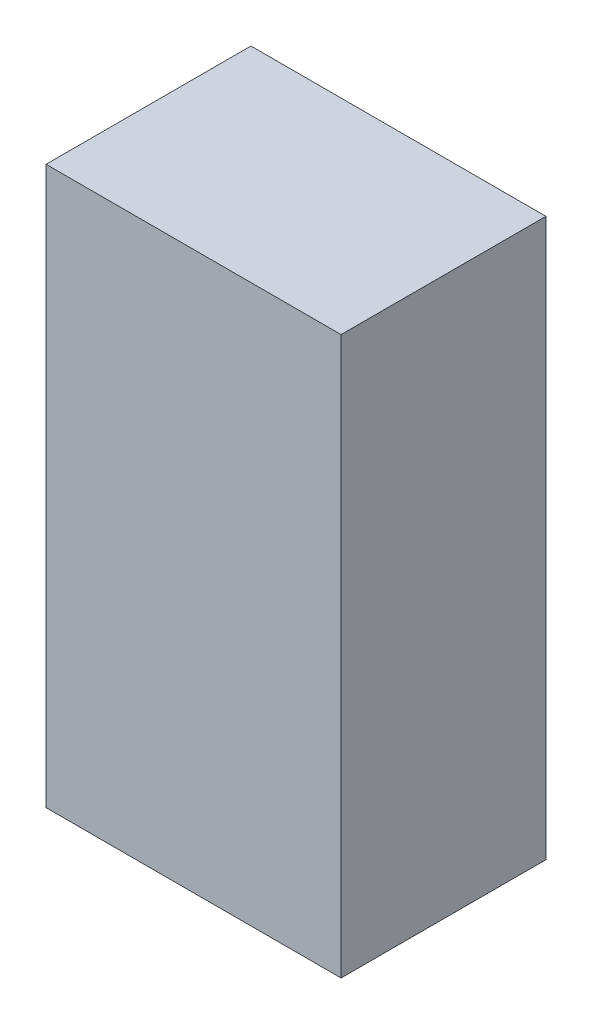
ISO-10303-21;
HEADER;
FILE_DESCRIPTION(('STEP AP214'),'2;1');
FILE_NAME('part.step','',(''),(''),'','','');
FILE_SCHEMA(('AUTOMOTIVE_DESIGN { 1 0 10303 214 1 1 1 1 }'));
ENDSEC;
DATA;
#1=APPLICATION_CONTEXT('core data for automotive mechanical design processes');
#2=APPLICATION_PROTOCOL_DEFINITION('international standard','automotive_design',2000,#1);
#3=PRODUCT_CONTEXT('',#1,'mechanical');
#4=PRODUCT('Part','Part','',(#3));
#5=PRODUCT_RELATED_PRODUCT_CATEGORY('part','',(#4));
#6=PRODUCT_DEFINITION_FORMATION('','',#4);
#7=PRODUCT_DEFINITION_CONTEXT('part definition',#1,'design');
#8=PRODUCT_DEFINITION('design','',#6,#7);
#9=PRODUCT_DEFINITION_SHAPE('','',#8);
#10=(LENGTH_UNIT() NAMED_UNIT(*) SI_UNIT(.MILLI.,.METRE.));
#11=(NAMED_UNIT(*) PLANE_ANGLE_UNIT() SI_UNIT($,.RADIAN.));
#12=(NAMED_UNIT(*) SI_UNIT($,.STERADIAN.) SOLID_ANGLE_UNIT());
#13=UNCERTAINTY_MEASURE_WITH_UNIT(LENGTH_MEASURE(1.E-05),#10,'distance_accuracy_value','');
#14=(GEOMETRIC_REPRESENTATION_CONTEXT(3) GLOBAL_UNCERTAINTY_ASSIGNED_CONTEXT((#13)) GLOBAL_UNIT_ASSIGNED_CONTEXT((#10,
#11,#12)) REPRESENTATION_CONTEXT('',''));
#15=CARTESIAN_POINT('',(0.,0.,0.));
#16=DIRECTION('',(0.,0.,1.));
#17=DIRECTION('',(1.,0.,0.));
#18=AXIS2_PLACEMENT_3D('',#15,#16,#17);
#19=CARTESIAN_POINT('',(0.90000074,-1.69999914,1.25000004));
#20=DIRECTION('',(0.,0.,1.));
#21=DIRECTION('',(1.,0.,0.));
#22=AXIS2_PLACEMENT_3D('',#19,#20,#21);
#23=PLANE('',#22);
#24=DIRECTION('',(0.,1.,0.));
#25=VECTOR('',#24,1.);
#26=CARTESIAN_POINT('',(-0.8999982,-1.69999914,1.25000004));
#27=LINE('',#26,#25);
#28=CARTESIAN_POINT('',(-0.8999982,-1.69999914,1.25000004));
#29=VERTEX_POINT('',#28);
#30=CARTESIAN_POINT('',(-0.8999982,1.70000168,1.25000004));
#31=VERTEX_POINT('',#30);
#32=EDGE_CURVE('E52',#29,#31,#27,.T.);
#33=ORIENTED_EDGE('',*,*,#32,.F.);
#34=DIRECTION('',(1.,0.,0.));
#35=VECTOR('',#34,1.);
#36=CARTESIAN_POINT('',(0.90000074,-1.69999914,1.25000004));
#37=LINE('',#36,#35);
#38=CARTESIAN_POINT('',(0.90000074,-1.69999914,1.25000004));
#39=VERTEX_POINT('',#38);
#40=EDGE_CURVE('E67',#39,#29,#37,.F.);
#41=ORIENTED_EDGE('',*,*,#40,.F.);
#42=DIRECTION('',(0.,1.,0.));
#43=VECTOR('',#42,1.);
#44=CARTESIAN_POINT('',(0.90000074,1.70000168,1.25000004));
#45=LINE('',#44,#43);
#46=CARTESIAN_POINT('',(0.90000074,1.70000168,1.25000004));
#47=VERTEX_POINT('',#46);
#48=EDGE_CURVE('E19',#47,#39,#45,.F.);
#49=ORIENTED_EDGE('',*,*,#48,.F.);
#50=DIRECTION('',(1.,0.,0.));
#51=VECTOR('',#50,1.);
#52=CARTESIAN_POINT('',(-0.8999982,1.70000168,1.25000004));
#53=LINE('',#52,#51);
#54=EDGE_CURVE('E57',#31,#47,#53,.T.);
#55=ORIENTED_EDGE('',*,*,#54,.F.);
#56=EDGE_LOOP('',(#33,#41,#49,#55));
#57=FACE_BOUND('',#56,.T.);
#58=ADVANCED_FACE('F16',(#57),#23,.T.);
#59=CARTESIAN_POINT('',(0.90000074,1.70000168,0.));
#60=DIRECTION('',(1.,0.,0.));
#61=DIRECTION('',(0.,0.,-1.));
#62=AXIS2_PLACEMENT_3D('',#59,#60,#61);
#63=PLANE('',#62);
#64=DIRECTION('',(0.,0.,-1.));
#65=VECTOR('',#64,1.);
#66=CARTESIAN_POINT('',(0.90000074,-1.69999914,0.));
#67=LINE('',#66,#65);
#68=CARTESIAN_POINT('',(0.90000074,-1.69999914,0.));
#69=VERTEX_POINT('',#68);
#70=EDGE_CURVE('E78',#69,#39,#67,.F.);
#71=ORIENTED_EDGE('',*,*,#70,.F.);
#72=DIRECTION('',(0.,1.,0.));
#73=VECTOR('',#72,1.);
#74=CARTESIAN_POINT('',(0.90000074,-1.69999914,0.));
#75=LINE('',#74,#73);
#76=CARTESIAN_POINT('',(0.90000074,1.70000168,0.));
#77=VERTEX_POINT('',#76);
#78=EDGE_CURVE('E73',#69,#77,#75,.T.);
#79=ORIENTED_EDGE('',*,*,#78,.T.);
#80=DIRECTION('',(0.,0.,1.));
#81=VECTOR('',#80,1.);
#82=CARTESIAN_POINT('',(0.90000074,1.70000168,0.));
#83=LINE('',#82,#81);
#84=EDGE_CURVE('E62',#47,#77,#83,.F.);
#85=ORIENTED_EDGE('',*,*,#84,.F.);
#86=ORIENTED_EDGE('',*,*,#48,.T.);
#87=EDGE_LOOP('',(#71,#79,#85,#86));
#88=FACE_BOUND('',#87,.T.);
#89=ADVANCED_FACE('F72',(#88),#63,.T.);
#90=CARTESIAN_POINT('',(-0.8999982,1.70000168,0.));
#91=DIRECTION('',(0.,1.,0.));
#92=DIRECTION('',(0.,0.,1.));
#93=AXIS2_PLACEMENT_3D('',#90,#91,#92);
#94=PLANE('',#93);
#95=ORIENTED_EDGE('',*,*,#84,.T.);
#96=DIRECTION('',(1.,0.,0.));
#97=VECTOR('',#96,1.);
#98=CARTESIAN_POINT('',(0.90000074,1.70000168,0.));
#99=LINE('',#98,#97);
#100=CARTESIAN_POINT('',(-0.8999982,1.70000168,0.));
#101=VERTEX_POINT('',#100);
#102=EDGE_CURVE('E83',#77,#101,#99,.F.);
#103=ORIENTED_EDGE('',*,*,#102,.T.);
#104=DIRECTION('',(0.,0.,1.));
#105=VECTOR('',#104,1.);
#106=CARTESIAN_POINT('',(-0.8999982,1.70000168,0.));
#107=LINE('',#106,#105);
#108=EDGE_CURVE('E64',#31,#101,#107,.F.);
#109=ORIENTED_EDGE('',*,*,#108,.F.);
#110=ORIENTED_EDGE('',*,*,#54,.T.);
#111=EDGE_LOOP('',(#95,#103,#109,#110));
#112=FACE_BOUND('',#111,.T.);
#113=ADVANCED_FACE('F59',(#112),#94,.T.);
#114=CARTESIAN_POINT('',(-0.8999982,-1.69999914,0.));
#115=DIRECTION('',(-1.,0.,0.));
#116=DIRECTION('',(0.,0.,1.));
#117=AXIS2_PLACEMENT_3D('',#114,#115,#116);
#118=PLANE('',#117);
#119=ORIENTED_EDGE('',*,*,#108,.T.);
#120=DIRECTION('',(0.,1.,0.));
#121=VECTOR('',#120,1.);
#122=CARTESIAN_POINT('',(-0.8999982,-1.69999914,0.));
#123=LINE('',#122,#121);
#124=CARTESIAN_POINT('',(-0.8999982,-1.69999914,0.));
#125=VERTEX_POINT('',#124);
#126=EDGE_CURVE('E25',#101,#125,#123,.F.);
#127=ORIENTED_EDGE('',*,*,#126,.T.);
#128=DIRECTION('',(0.,0.,-1.));
#129=VECTOR('',#128,1.);
#130=CARTESIAN_POINT('',(-0.8999982,-1.69999914,0.));
#131=LINE('',#130,#129);
#132=EDGE_CURVE('E33',#29,#125,#131,.T.);
#133=ORIENTED_EDGE('',*,*,#132,.F.);
#134=ORIENTED_EDGE('',*,*,#32,.T.);
#135=EDGE_LOOP('',(#119,#127,#133,#134));
#136=FACE_BOUND('',#135,.T.);
#137=ADVANCED_FACE('F87',(#136),#118,.T.);
#138=CARTESIAN_POINT('',(0.90000074,-1.69999914,0.));
#139=DIRECTION('',(0.,-1.,0.));
#140=DIRECTION('',(0.,0.,-1.));
#141=AXIS2_PLACEMENT_3D('',#138,#139,#140);
#142=PLANE('',#141);
#143=ORIENTED_EDGE('',*,*,#132,.T.);
#144=DIRECTION('',(1.,0.,0.));
#145=VECTOR('',#144,1.);
#146=CARTESIAN_POINT('',(0.90000074,-1.69999914,0.));
#147=LINE('',#146,#145);
#148=EDGE_CURVE('E11',#125,#69,#147,.T.);
#149=ORIENTED_EDGE('',*,*,#148,.T.);
#150=ORIENTED_EDGE('',*,*,#70,.T.);
#151=ORIENTED_EDGE('',*,*,#40,.T.);
#152=EDGE_LOOP('',(#143,#149,#150,#151));
#153=FACE_BOUND('',#152,.T.);
#154=ADVANCED_FACE('F90',(#153),#142,.T.);
#155=CARTESIAN_POINT('',(0.90000074,-1.69999914,0.));
#156=DIRECTION('',(0.,0.,1.));
#157=DIRECTION('',(1.,0.,0.));
#158=AXIS2_PLACEMENT_3D('',#155,#156,#157);
#159=PLANE('',#158);
#160=ORIENTED_EDGE('',*,*,#126,.F.);
#161=ORIENTED_EDGE('',*,*,#102,.F.);
#162=ORIENTED_EDGE('',*,*,#78,.F.);
#163=ORIENTED_EDGE('',*,*,#148,.F.);
#164=EDGE_LOOP('',(#160,#161,#162,#163));
#165=FACE_BOUND('',#164,.T.);
#166=ADVANCED_FACE('F89',(#165),#159,.F.);
#167=CLOSED_SHELL('',(#58,#89,#113,#137,#154,#166));
#168=MANIFOLD_SOLID_BREP('B1',#167);
#169=ADVANCED_BREP_SHAPE_REPRESENTATION('',(#18,#168),#14);
#170=SHAPE_DEFINITION_REPRESENTATION(#9,#169);
ENDSEC;
END-ISO-10303-21;
